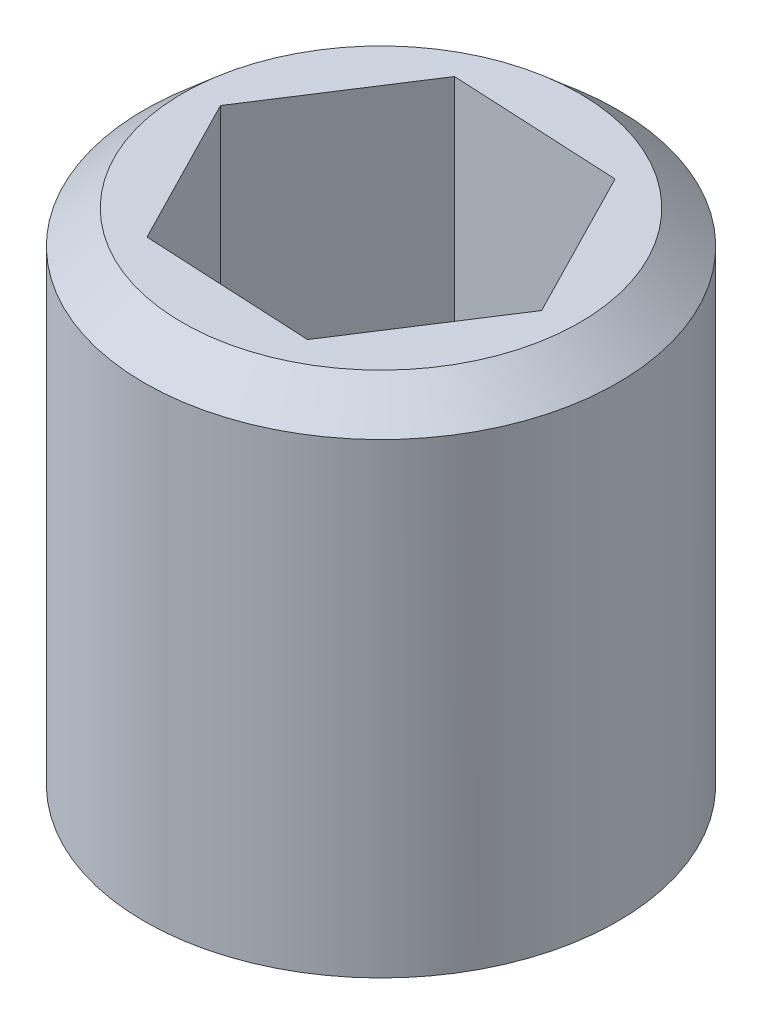
ISO-10303-21;
HEADER;
FILE_DESCRIPTION(('STEP AP214'),'2;1');
FILE_NAME('part.step','',(''),(''),'','','');
FILE_SCHEMA(('AUTOMOTIVE_DESIGN { 1 0 10303 214 1 1 1 1 }'));
ENDSEC;
DATA;
#1=APPLICATION_CONTEXT('core data for automotive mechanical design processes');
#2=APPLICATION_PROTOCOL_DEFINITION('international standard','automotive_design',2000,#1);
#3=PRODUCT_CONTEXT('',#1,'mechanical');
#4=PRODUCT('Part','Part','',(#3));
#5=PRODUCT_RELATED_PRODUCT_CATEGORY('part','',(#4));
#6=PRODUCT_DEFINITION_FORMATION('','',#4);
#7=PRODUCT_DEFINITION_CONTEXT('part definition',#1,'design');
#8=PRODUCT_DEFINITION('design','',#6,#7);
#9=PRODUCT_DEFINITION_SHAPE('','',#8);
#10=(LENGTH_UNIT() NAMED_UNIT(*) SI_UNIT(.MILLI.,.METRE.));
#11=(NAMED_UNIT(*) PLANE_ANGLE_UNIT() SI_UNIT($,.RADIAN.));
#12=(NAMED_UNIT(*) SI_UNIT($,.STERADIAN.) SOLID_ANGLE_UNIT());
#13=UNCERTAINTY_MEASURE_WITH_UNIT(LENGTH_MEASURE(1.E-05),#10,'distance_accuracy_value','');
#14=(GEOMETRIC_REPRESENTATION_CONTEXT(3) GLOBAL_UNCERTAINTY_ASSIGNED_CONTEXT((#13)) GLOBAL_UNIT_ASSIGNED_CONTEXT((#10,
#11,#12)) REPRESENTATION_CONTEXT('',''));
#15=CARTESIAN_POINT('',(0.,0.,0.));
#16=DIRECTION('',(0.,0.,1.));
#17=DIRECTION('',(1.,0.,0.));
#18=AXIS2_PLACEMENT_3D('',#15,#16,#17);
#19=CARTESIAN_POINT('',(-1.15324825568513,6.,3.19210531896163));
#20=DIRECTION('',(-0.89000532402546,0.,0.455950132367933));
#21=DIRECTION('',(0.455950132367933,0.,0.89000532402546));
#22=AXIS2_PLACEMENT_3D('',#19,#20,#21);
#23=PLANE('',#22);
#24=DIRECTION('',(0.,1.,0.));
#25=VECTOR('',#24,1.);
#26=CARTESIAN_POINT('',(-0.626762392365789,6.,4.21979494577423));
#27=LINE('',#26,#25);
#28=CARTESIAN_POINT('',(-0.626762392365788,9.,4.21979494577423));
#29=VERTEX_POINT('',#28);
#30=CARTESIAN_POINT('',(-0.626762392365788,6.,4.21979494577423));
#31=VERTEX_POINT('',#30);
#32=EDGE_CURVE('E83',#29,#31,#27,.F.);
#33=ORIENTED_EDGE('',*,*,#32,.T.);
#34=DIRECTION('',(0.455950132367933,0.,0.89000532402546));
#35=VECTOR('',#34,1.);
#36=CARTESIAN_POINT('',(-1.15324825568513,6.,3.19210531896163));
#37=LINE('',#36,#35);
#38=CARTESIAN_POINT('',(-1.15324825568513,6.,3.19210531896163));
#39=VERTEX_POINT('',#38);
#40=EDGE_CURVE('E72',#39,#31,#37,.T.);
#41=ORIENTED_EDGE('',*,*,#40,.F.);
#42=DIRECTION('',(0.,1.,0.));
#43=VECTOR('',#42,1.);
#44=CARTESIAN_POINT('',(-1.15324825568513,6.,3.19210531896163));
#45=LINE('',#44,#43);
#46=CARTESIAN_POINT('',(-1.15324825568513,9.,3.19210531896163));
#47=VERTEX_POINT('',#46);
#48=EDGE_CURVE('E91',#39,#47,#45,.T.);
#49=ORIENTED_EDGE('',*,*,#48,.T.);
#50=DIRECTION('',(0.455950132367933,0.,0.89000532402546));
#51=VECTOR('',#50,1.);
#52=CARTESIAN_POINT('',(-1.15324825568513,9.,3.19210531896163));
#53=LINE('',#52,#51);
#54=EDGE_CURVE('E67',#29,#47,#53,.F.);
#55=ORIENTED_EDGE('',*,*,#54,.F.);
#56=EDGE_LOOP('',(#33,#41,#49,#55));
#57=FACE_BOUND('',#56,.T.);
#58=ADVANCED_FACE('F17',(#57),#23,.F.);
#59=CARTESIAN_POINT('',(-0.626762392365789,6.,4.21979494577423));
#60=DIRECTION('',(-0.0501382645232233,0.,0.998742286293416));
#61=DIRECTION('',(0.998742286293416,0.,0.0501382645232233));
#62=AXIS2_PLACEMENT_3D('',#59,#60,#61);
#63=PLANE('',#62);
#64=DIRECTION('',(0.,1.,0.));
#65=VECTOR('',#64,1.);
#66=CARTESIAN_POINT('',(0.526485863319344,6.,4.2776896268126));
#67=LINE('',#66,#65);
#68=CARTESIAN_POINT('',(0.526485863319344,9.,4.2776896268126));
#69=VERTEX_POINT('',#68);
#70=CARTESIAN_POINT('',(0.526485863319344,6.,4.2776896268126));
#71=VERTEX_POINT('',#70);
#72=EDGE_CURVE('E87',#69,#71,#67,.F.);
#73=ORIENTED_EDGE('',*,*,#72,.T.);
#74=DIRECTION('',(0.998742286293416,0.,0.0501382645232233));
#75=VECTOR('',#74,1.);
#76=CARTESIAN_POINT('',(-0.626762392365789,6.,4.21979494577423));
#77=LINE('',#76,#75);
#78=EDGE_CURVE('E76',#31,#71,#77,.T.);
#79=ORIENTED_EDGE('',*,*,#78,.F.);
#80=ORIENTED_EDGE('',*,*,#32,.F.);
#81=DIRECTION('',(0.998742286293416,0.,0.0501382645232233));
#82=VECTOR('',#81,1.);
#83=CARTESIAN_POINT('',(-0.626762392365789,9.,4.21979494577423));
#84=LINE('',#83,#82);
#85=EDGE_CURVE('E89',#69,#29,#84,.F.);
#86=ORIENTED_EDGE('',*,*,#85,.F.);
#87=EDGE_LOOP('',(#73,#79,#80,#86));
#88=FACE_BOUND('',#87,.T.);
#89=ADVANCED_FACE('F86',(#88),#63,.F.);
#90=CARTESIAN_POINT('',(-0.526485863319343,6.,2.2223103731874));
#91=DIRECTION('',(-0.839867059502238,0.,-0.542792153925483));
#92=DIRECTION('',(-0.542792153925483,0.,0.839867059502238));
#93=AXIS2_PLACEMENT_3D('',#90,#91,#92);
#94=PLANE('',#93);
#95=ORIENTED_EDGE('',*,*,#48,.F.);
#96=DIRECTION('',(-0.542792153925483,0.,0.839867059502237));
#97=VECTOR('',#96,1.);
#98=CARTESIAN_POINT('',(-0.526485863319343,6.,2.2223103731874));
#99=LINE('',#98,#97);
#100=CARTESIAN_POINT('',(-0.526485863319343,6.,2.2223103731874));
#101=VERTEX_POINT('',#100);
#102=EDGE_CURVE('E79',#101,#39,#99,.T.);
#103=ORIENTED_EDGE('',*,*,#102,.F.);
#104=DIRECTION('',(0.,1.,0.));
#105=VECTOR('',#104,1.);
#106=CARTESIAN_POINT('',(-0.526485863319343,6.,2.2223103731874));
#107=LINE('',#106,#105);
#108=CARTESIAN_POINT('',(-0.526485863319343,9.,2.2223103731874));
#109=VERTEX_POINT('',#108);
#110=EDGE_CURVE('E120',#101,#109,#107,.T.);
#111=ORIENTED_EDGE('',*,*,#110,.T.);
#112=DIRECTION('',(-0.542792153925483,0.,0.839867059502238));
#113=VECTOR('',#112,1.);
#114=CARTESIAN_POINT('',(-0.526485863319343,9.,2.2223103731874));
#115=LINE('',#114,#113);
#116=EDGE_CURVE('E130',#47,#109,#115,.F.);
#117=ORIENTED_EDGE('',*,*,#116,.F.);
#118=EDGE_LOOP('',(#95,#103,#111,#117));
#119=FACE_BOUND('',#118,.T.);
#120=ADVANCED_FACE('F133',(#119),#94,.F.);
#121=CARTESIAN_POINT('',(0.526485863319344,6.,4.2776896268126));
#122=DIRECTION('',(0.839867059502238,0.,0.542792153925483));
#123=DIRECTION('',(0.542792153925483,0.,-0.839867059502238));
#124=AXIS2_PLACEMENT_3D('',#121,#122,#123);
#125=PLANE('',#124);
#126=DIRECTION('',(0.,1.,0.));
#127=VECTOR('',#126,1.);
#128=CARTESIAN_POINT('',(1.15324825568513,6.,3.30789468103837));
#129=LINE('',#128,#127);
#130=CARTESIAN_POINT('',(1.15324825568513,9.,3.30789468103837));
#131=VERTEX_POINT('',#130);
#132=CARTESIAN_POINT('',(1.15324825568513,6.,3.30789468103837));
#133=VERTEX_POINT('',#132);
#134=EDGE_CURVE('E116',#131,#133,#129,.F.);
#135=ORIENTED_EDGE('',*,*,#134,.T.);
#136=DIRECTION('',(0.542792153925482,0.,-0.839867059502238));
#137=VECTOR('',#136,1.);
#138=CARTESIAN_POINT('',(0.526485863319344,6.,4.2776896268126));
#139=LINE('',#138,#137);
#140=EDGE_CURVE('E126',#71,#133,#139,.T.);
#141=ORIENTED_EDGE('',*,*,#140,.F.);
#142=ORIENTED_EDGE('',*,*,#72,.F.);
#143=DIRECTION('',(0.542792153925483,0.,-0.839867059502238));
#144=VECTOR('',#143,1.);
#145=CARTESIAN_POINT('',(0.526485863319344,9.,4.2776896268126));
#146=LINE('',#145,#144);
#147=EDGE_CURVE('E35',#131,#69,#146,.F.);
#148=ORIENTED_EDGE('',*,*,#147,.F.);
#149=EDGE_LOOP('',(#135,#141,#142,#148));
#150=FACE_BOUND('',#149,.T.);
#151=ADVANCED_FACE('F138',(#150),#125,.F.);
#152=CARTESIAN_POINT('',(0.,6.,0.));
#153=DIRECTION('',(0.,1.,0.));
#154=DIRECTION('',(0.,0.,1.));
#155=AXIS2_PLACEMENT_3D('',#152,#153,#154);
#156=PLANE('',#155);
#157=ORIENTED_EDGE('',*,*,#40,.T.);
#158=ORIENTED_EDGE('',*,*,#78,.T.);
#159=ORIENTED_EDGE('',*,*,#140,.T.);
#160=DIRECTION('',(-0.455950132367933,0.,-0.89000532402546));
#161=VECTOR('',#160,1.);
#162=CARTESIAN_POINT('',(1.15324825568513,6.,3.30789468103837));
#163=LINE('',#162,#161);
#164=CARTESIAN_POINT('',(0.626762392365788,6.,2.28020505422577));
#165=VERTEX_POINT('',#164);
#166=EDGE_CURVE('E112',#133,#165,#163,.T.);
#167=ORIENTED_EDGE('',*,*,#166,.T.);
#168=DIRECTION('',(-0.998742286293416,0.,-0.0501382645232233));
#169=VECTOR('',#168,1.);
#170=CARTESIAN_POINT('',(0.626762392365789,6.,2.28020505422577));
#171=LINE('',#170,#169);
#172=EDGE_CURVE('E123',#165,#101,#171,.T.);
#173=ORIENTED_EDGE('',*,*,#172,.T.);
#174=ORIENTED_EDGE('',*,*,#102,.T.);
#175=EDGE_LOOP('',(#157,#158,#159,#167,#173,#174));
#176=FACE_BOUND('',#175,.T.);
#177=ADVANCED_FACE('F73',(#176),#156,.T.);
#178=CARTESIAN_POINT('',(0.626762392365789,6.,2.28020505422577));
#179=DIRECTION('',(0.0501382645232233,0.,-0.998742286293416));
#180=DIRECTION('',(-0.998742286293416,0.,-0.0501382645232233));
#181=AXIS2_PLACEMENT_3D('',#178,#179,#180);
#182=PLANE('',#181);
#183=ORIENTED_EDGE('',*,*,#110,.F.);
#184=ORIENTED_EDGE('',*,*,#172,.F.);
#185=DIRECTION('',(0.,1.,0.));
#186=VECTOR('',#185,1.);
#187=CARTESIAN_POINT('',(0.626762392365787,6.,2.28020505422577));
#188=LINE('',#187,#186);
#189=CARTESIAN_POINT('',(0.626762392365788,9.,2.28020505422577));
#190=VERTEX_POINT('',#189);
#191=EDGE_CURVE('E106',#165,#190,#188,.T.);
#192=ORIENTED_EDGE('',*,*,#191,.T.);
#193=DIRECTION('',(-0.998742286293416,0.,-0.0501382645232233));
#194=VECTOR('',#193,1.);
#195=CARTESIAN_POINT('',(0.626762392365789,9.,2.28020505422577));
#196=LINE('',#195,#194);
#197=EDGE_CURVE('E117',#109,#190,#196,.F.);
#198=ORIENTED_EDGE('',*,*,#197,.F.);
#199=EDGE_LOOP('',(#183,#184,#192,#198));
#200=FACE_BOUND('',#199,.T.);
#201=ADVANCED_FACE('F143',(#200),#182,.F.);
#202=CARTESIAN_POINT('',(1.15324825568513,6.,3.30789468103837));
#203=DIRECTION('',(0.89000532402546,0.,-0.455950132367933));
#204=DIRECTION('',(-0.455950132367933,0.,-0.89000532402546));
#205=AXIS2_PLACEMENT_3D('',#202,#203,#204);
#206=PLANE('',#205);
#207=ORIENTED_EDGE('',*,*,#191,.F.);
#208=ORIENTED_EDGE('',*,*,#166,.F.);
#209=ORIENTED_EDGE('',*,*,#134,.F.);
#210=DIRECTION('',(-0.455950132367931,0.,-0.890005324025461));
#211=VECTOR('',#210,1.);
#212=CARTESIAN_POINT('',(1.15324825568513,9.,3.30789468103837));
#213=LINE('',#212,#211);
#214=EDGE_CURVE('E102',#131,#190,#213,.T.);
#215=ORIENTED_EDGE('',*,*,#214,.T.);
#216=EDGE_LOOP('',(#207,#208,#209,#215));
#217=FACE_BOUND('',#216,.T.);
#218=ADVANCED_FACE('F141',(#217),#206,.F.);
#219=CARTESIAN_POINT('',(0.,5.,3.84582802539439));
#220=DIRECTION('',(0.,1.,0.));
#221=DIRECTION('',(0.,0.,1.));
#222=AXIS2_PLACEMENT_3D('',#219,#220,#221);
#223=PLANE('',#222);
#224=CARTESIAN_POINT('',(0.,4.99999999998334,3.25));
#225=DIRECTION('',(0.,1.,0.));
#226=DIRECTION('',(0.,0.,1.));
#227=AXIS2_PLACEMENT_3D('',#224,#225,#226);
#228=CIRCLE('',#227,0.595828025325318);
#229=CARTESIAN_POINT('',(0.,4.99999999998334,3.84582802532532));
#230=VERTEX_POINT('',#229);
#231=EDGE_CURVE('E20',#230,#230,#228,.T.);
#232=ORIENTED_EDGE('',*,*,#231,.F.);
#233=EDGE_LOOP('',(#232));
#234=FACE_BOUND('',#233,.T.);
#235=ADVANCED_FACE('F151',(#234),#223,.F.);
#236=CARTESIAN_POINT('',(0.,9.,3.25));
#237=DIRECTION('',(0.,-1.,0.));
#238=DIRECTION('',(0.,0.,-1.));
#239=AXIS2_PLACEMENT_3D('',#236,#237,#238);
#240=PLANE('',#239);
#241=CARTESIAN_POINT('',(0.,8.99999999998247,3.25));
#242=DIRECTION('',(0.,-1.,0.));
#243=DIRECTION('',(0.,0.,-1.));
#244=AXIS2_PLACEMENT_3D('',#241,#242,#243);
#245=CIRCLE('',#244,1.35442592875279);
#246=CARTESIAN_POINT('',(0.,8.99999999998247,1.89557407124721));
#247=VERTEX_POINT('',#246);
#248=EDGE_CURVE('E95',#247,#247,#245,.T.);
#249=ORIENTED_EDGE('',*,*,#248,.F.);
#250=EDGE_LOOP('',(#249));
#251=FACE_BOUND('',#250,.T.);
#252=ORIENTED_EDGE('',*,*,#147,.T.);
#253=ORIENTED_EDGE('',*,*,#85,.T.);
#254=ORIENTED_EDGE('',*,*,#54,.T.);
#255=ORIENTED_EDGE('',*,*,#116,.T.);
#256=ORIENTED_EDGE('',*,*,#197,.T.);
#257=ORIENTED_EDGE('',*,*,#214,.F.);
#258=EDGE_LOOP('',(#252,#253,#254,#255,#256,#257));
#259=FACE_BOUND('',#258,.T.);
#260=ADVANCED_FACE('F137',(#251,#259),#240,.F.);
#261=CARTESIAN_POINT('',(0.,5.59286359862199,3.25));
#262=DIRECTION('',(0.,1.,0.));
#263=DIRECTION('',(0.,0.,1.));
#264=AXIS2_PLACEMENT_3D('',#261,#262,#263);
#265=CONICAL_SURFACE('',#264,1.61433728457314,1.04365038322902);
#266=CARTESIAN_POINT('',(0.,5.59286359862151,3.25));
#267=DIRECTION('',(0.,1.,0.));
#268=DIRECTION('',(0.,0.,1.));
#269=AXIS2_PLACEMENT_3D('',#266,#267,#268);
#270=CIRCLE('',#269,1.61433728456468);
#271=CARTESIAN_POINT('',(0.,5.59286359862151,4.86433728456468));
#272=VERTEX_POINT('',#271);
#273=EDGE_CURVE('E26',#272,#272,#270,.T.);
#274=ORIENTED_EDGE('',*,*,#273,.F.);
#275=EDGE_LOOP('',(#274));
#276=FACE_BOUND('',#275,.T.);
#277=ORIENTED_EDGE('',*,*,#231,.T.);
#278=EDGE_LOOP('',(#277));
#279=FACE_BOUND('',#278,.T.);
#280=ADVANCED_FACE('F162',(#276,#279),#265,.T.);
#281=CARTESIAN_POINT('',(0.,8.77366078282193,3.25));
#282=DIRECTION('',(0.,-1.,0.));
#283=DIRECTION('',(0.,0.,-1.));
#284=AXIS2_PLACEMENT_3D('',#281,#282,#283);
#285=CONICAL_SURFACE('',#284,1.61433728461316,0.854331646248377);
#286=ORIENTED_EDGE('',*,*,#248,.T.);
#287=EDGE_LOOP('',(#286));
#288=FACE_BOUND('',#287,.T.);
#289=CARTESIAN_POINT('',(0.,8.7736607828091,3.25));
#290=DIRECTION('',(0.,1.,0.));
#291=DIRECTION('',(0.,0.,1.));
#292=AXIS2_PLACEMENT_3D('',#289,#290,#291);
#293=CIRCLE('',#292,1.61433728456468);
#294=CARTESIAN_POINT('',(0.,8.7736607828091,4.86433728456468));
#295=VERTEX_POINT('',#294);
#296=EDGE_CURVE('E11',#295,#295,#293,.F.);
#297=ORIENTED_EDGE('',*,*,#296,.F.);
#298=EDGE_LOOP('',(#297));
#299=FACE_BOUND('',#298,.T.);
#300=ADVANCED_FACE('F156',(#288,#299),#285,.T.);
#301=CARTESIAN_POINT('',(0.,1.49143096545149,3.25));
#302=DIRECTION('',(0.,1.,0.));
#303=DIRECTION('',(0.,0.,1.));
#304=AXIS2_PLACEMENT_3D('',#301,#302,#303);
#305=CYLINDRICAL_SURFACE('',#304,1.61433728456468);
#306=ORIENTED_EDGE('',*,*,#273,.T.);
#307=EDGE_LOOP('',(#306));
#308=FACE_BOUND('',#307,.T.);
#309=ORIENTED_EDGE('',*,*,#296,.T.);
#310=EDGE_LOOP('',(#309));
#311=FACE_BOUND('',#310,.T.);
#312=ADVANCED_FACE('F154',(#308,#311),#305,.T.);
#313=CLOSED_SHELL('',(#58,#89,#120,#151,#177,#201,#218,#235,#260,#280,#300,#312));
#314=MANIFOLD_SOLID_BREP('B1',#313);
#315=ADVANCED_BREP_SHAPE_REPRESENTATION('',(#18,#314),#14);
#316=SHAPE_DEFINITION_REPRESENTATION(#9,#315);
ENDSEC;
END-ISO-10303-21;
